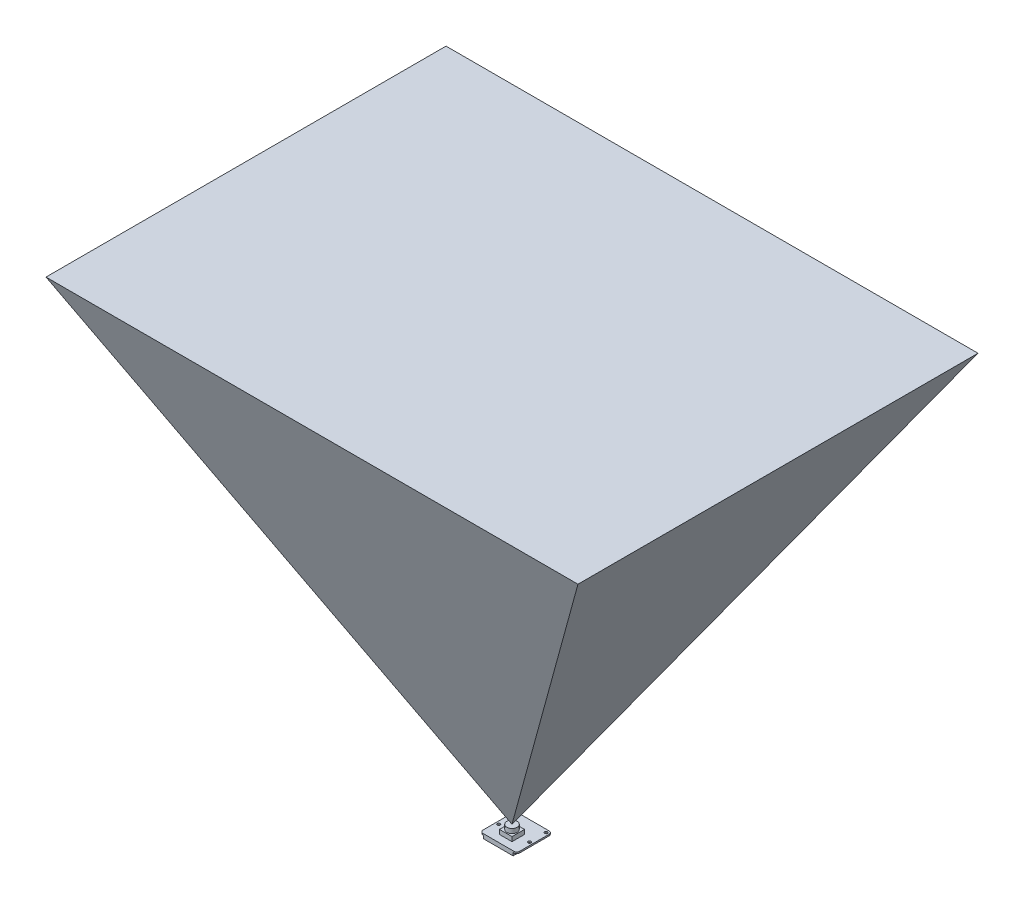
ISO-10303-21;
HEADER;
FILE_DESCRIPTION(('STEP AP214'),'2;1');
FILE_NAME('part.step','',(''),(''),'','','');
FILE_SCHEMA(('AUTOMOTIVE_DESIGN { 1 0 10303 214 1 1 1 1 }'));
ENDSEC;
DATA;
#1=APPLICATION_CONTEXT('core data for automotive mechanical design processes');
#2=APPLICATION_PROTOCOL_DEFINITION('international standard','automotive_design',2000,#1);
#3=PRODUCT_CONTEXT('',#1,'mechanical');
#4=PRODUCT('Part','Part','',(#3));
#5=PRODUCT_RELATED_PRODUCT_CATEGORY('part','',(#4));
#6=PRODUCT_DEFINITION_FORMATION('','',#4);
#7=PRODUCT_DEFINITION_CONTEXT('part definition',#1,'design');
#8=PRODUCT_DEFINITION('design','',#6,#7);
#9=PRODUCT_DEFINITION_SHAPE('','',#8);
#10=(LENGTH_UNIT() NAMED_UNIT(*) SI_UNIT(.MILLI.,.METRE.));
#11=(NAMED_UNIT(*) PLANE_ANGLE_UNIT() SI_UNIT($,.RADIAN.));
#12=(NAMED_UNIT(*) SI_UNIT($,.STERADIAN.) SOLID_ANGLE_UNIT());
#13=UNCERTAINTY_MEASURE_WITH_UNIT(LENGTH_MEASURE(1.E-05),#10,'distance_accuracy_value','');
#14=(GEOMETRIC_REPRESENTATION_CONTEXT(3) GLOBAL_UNCERTAINTY_ASSIGNED_CONTEXT((#13)) GLOBAL_UNIT_ASSIGNED_CONTEXT((#10,
#11,#12)) REPRESENTATION_CONTEXT('',''));
#15=CARTESIAN_POINT('',(0.,0.,0.));
#16=DIRECTION('',(0.,0.,1.));
#17=DIRECTION('',(1.,0.,0.));
#18=AXIS2_PLACEMENT_3D('',#15,#16,#17);
#19=CARTESIAN_POINT('',(193.471570023997,307.,200.));
#20=DIRECTION('',(-0.856267084600329,0.516533328866641,0.));
#21=DIRECTION('',(-0.516533328866641,-0.856267084600329,0.));
#22=AXIS2_PLACEMENT_3D('',#19,#20,#21);
#23=PLANE('',#22);
#24=DIRECTION('',(-0.481487702973172,-0.798171286643521,-0.36206655336201));
#25=VECTOR('',#24,1.);
#26=CARTESIAN_POINT('',(206.226287357831,328.143736552889,136.427259722615));
#27=LINE('',#26,#25);
#28=CARTESIAN_POINT('',(193.471570023997,307.,126.836035449074));
#29=VERTEX_POINT('',#28);
#30=CARTESIAN_POINT('',(12.5,7.,-9.24999999999999));
#31=VERTEX_POINT('',#30);
#32=EDGE_CURVE('E93',#29,#31,#27,.T.);
#33=ORIENTED_EDGE('',*,*,#32,.T.);
#34=DIRECTION('',(0.481487702973172,0.798171286643521,-0.36206655336201));
#35=VECTOR('',#34,1.);
#36=CARTESIAN_POINT('',(133.268934144774,207.200950009044,-100.065178599563));
#37=LINE('',#36,#35);
#38=CARTESIAN_POINT('',(193.471570023997,307.,-145.336035449074));
#39=VERTEX_POINT('',#38);
#40=EDGE_CURVE('E85',#31,#39,#37,.T.);
#41=ORIENTED_EDGE('',*,*,#40,.T.);
#42=DIRECTION('',(0.,0.,-1.));
#43=VECTOR('',#42,1.);
#44=CARTESIAN_POINT('',(193.471570023997,307.,200.));
#45=LINE('',#44,#43);
#46=EDGE_CURVE('E12',#29,#39,#45,.T.);
#47=ORIENTED_EDGE('',*,*,#46,.F.);
#48=EDGE_LOOP('',(#33,#41,#47));
#49=FACE_BOUND('',#48,.T.);
#50=ADVANCED_FACE('F55',(#49),#23,.F.);
#51=CARTESIAN_POINT('',(200.,307.,-145.336035449074));
#52=DIRECTION('',(0.,0.41310442982454,0.910683660806178));
#53=DIRECTION('',(0.,-0.910683660806178,0.41310442982454));
#54=AXIS2_PLACEMENT_3D('',#51,#52,#53);
#55=PLANE('',#54);
#56=ORIENTED_EDGE('',*,*,#40,.F.);
#57=DIRECTION('',(0.481487702973172,-0.798171286643521,0.36206655336201));
#58=VECTOR('',#57,1.);
#59=CARTESIAN_POINT('',(48.9786766065282,-53.4713932719229,18.1810405615259));
#60=LINE('',#59,#58);
#61=CARTESIAN_POINT('',(-168.471570023997,307.,-145.336035449074));
#62=VERTEX_POINT('',#61);
#63=EDGE_CURVE('E89',#62,#31,#60,.T.);
#64=ORIENTED_EDGE('',*,*,#63,.F.);
#65=DIRECTION('',(-1.,0.,0.));
#66=VECTOR('',#65,1.);
#67=CARTESIAN_POINT('',(200.,307.,-145.336035449074));
#68=LINE('',#67,#66);
#69=EDGE_CURVE('E64',#39,#62,#68,.T.);
#70=ORIENTED_EDGE('',*,*,#69,.F.);
#71=EDGE_LOOP('',(#56,#64,#70));
#72=FACE_BOUND('',#71,.T.);
#73=ADVANCED_FACE('F87',(#72),#55,.F.);
#74=CARTESIAN_POINT('',(12.5,7.,200.));
#75=DIRECTION('',(0.856267084600329,0.516533328866641,0.));
#76=DIRECTION('',(-0.516533328866641,0.856267084600329,0.));
#77=AXIS2_PLACEMENT_3D('',#74,#75,#76);
#78=PLANE('',#77);
#79=DIRECTION('',(0.,0.,-1.));
#80=VECTOR('',#79,1.);
#81=CARTESIAN_POINT('',(-168.471570023997,307.,200.));
#82=LINE('',#81,#80);
#83=CARTESIAN_POINT('',(-168.471570023997,307.,126.836035449074));
#84=VERTEX_POINT('',#83);
#85=EDGE_CURVE('E99',#84,#62,#82,.T.);
#86=ORIENTED_EDGE('',*,*,#85,.T.);
#87=ORIENTED_EDGE('',*,*,#63,.T.);
#88=DIRECTION('',(-0.481487702973172,0.798171286643521,0.36206655336201));
#89=VECTOR('',#88,1.);
#90=CARTESIAN_POINT('',(-23.9786766065282,67.4713932719229,18.1810405615259));
#91=LINE('',#90,#89);
#92=EDGE_CURVE('E59',#31,#84,#91,.T.);
#93=ORIENTED_EDGE('',*,*,#92,.T.);
#94=EDGE_LOOP('',(#86,#87,#93));
#95=FACE_BOUND('',#94,.T.);
#96=ADVANCED_FACE('F57',(#95),#78,.F.);
#97=CARTESIAN_POINT('',(200.,7.,-9.25));
#98=DIRECTION('',(0.,0.41310442982454,-0.910683660806178));
#99=DIRECTION('',(0.,0.910683660806178,0.41310442982454));
#100=AXIS2_PLACEMENT_3D('',#97,#98,#99);
#101=PLANE('',#100);
#102=ORIENTED_EDGE('',*,*,#32,.F.);
#103=DIRECTION('',(-1.,0.,0.));
#104=VECTOR('',#103,1.);
#105=CARTESIAN_POINT('',(200.,307.,126.836035449074));
#106=LINE('',#105,#104);
#107=EDGE_CURVE('E78',#29,#84,#106,.T.);
#108=ORIENTED_EDGE('',*,*,#107,.T.);
#109=ORIENTED_EDGE('',*,*,#92,.F.);
#110=EDGE_LOOP('',(#102,#108,#109));
#111=FACE_BOUND('',#110,.T.);
#112=ADVANCED_FACE('F101',(#111),#101,.F.);
#113=CARTESIAN_POINT('',(-168.471570023997,307.,200.));
#114=DIRECTION('',(0.,-1.,0.));
#115=DIRECTION('',(0.,0.,-1.));
#116=AXIS2_PLACEMENT_3D('',#113,#114,#115);
#117=PLANE('',#116);
#118=ORIENTED_EDGE('',*,*,#107,.F.);
#119=ORIENTED_EDGE('',*,*,#46,.T.);
#120=ORIENTED_EDGE('',*,*,#69,.T.);
#121=ORIENTED_EDGE('',*,*,#85,.F.);
#122=EDGE_LOOP('',(#118,#119,#120,#121));
#123=FACE_BOUND('',#122,.T.);
#124=ADVANCED_FACE('F105',(#123),#117,.F.);
#125=CLOSED_SHELL('',(#50,#73,#96,#112,#124));
#126=MANIFOLD_SOLID_BREP('B2',#125);
#127=CARTESIAN_POINT('',(0.,1.,0.));
#128=DIRECTION('',(0.,-1.,0.));
#129=DIRECTION('',(0.,0.,-1.));
#130=AXIS2_PLACEMENT_3D('',#127,#128,#129);
#131=PLANE('',#130);
#132=CARTESIAN_POINT('',(23.,1.,-10.7));
#133=DIRECTION('',(0.,1.,0.));
#134=DIRECTION('',(0.,0.,1.));
#135=AXIS2_PLACEMENT_3D('',#132,#133,#134);
#136=CIRCLE('',#135,1.);
#137=CARTESIAN_POINT('',(23.,1.,-9.7));
#138=VERTEX_POINT('',#137);
#139=EDGE_CURVE('E428',#138,#138,#136,.T.);
#140=ORIENTED_EDGE('',*,*,#139,.F.);
#141=EDGE_LOOP('',(#140));
#142=FACE_BOUND('',#141,.T.);
#143=CARTESIAN_POINT('',(23.,1.,-22.));
#144=DIRECTION('',(0.,1.,0.));
#145=DIRECTION('',(0.,0.,1.));
#146=AXIS2_PLACEMENT_3D('',#143,#144,#145);
#147=CIRCLE('',#146,1.);
#148=CARTESIAN_POINT('',(23.,1.,-21.));
#149=VERTEX_POINT('',#148);
#150=EDGE_CURVE('E431',#149,#149,#147,.T.);
#151=ORIENTED_EDGE('',*,*,#150,.F.);
#152=EDGE_LOOP('',(#151));
#153=FACE_BOUND('',#152,.T.);
#154=CARTESIAN_POINT('',(2.,1.,-22.));
#155=DIRECTION('',(0.,1.,0.));
#156=DIRECTION('',(0.,0.,1.));
#157=AXIS2_PLACEMENT_3D('',#154,#155,#156);
#158=CIRCLE('',#157,1.);
#159=CARTESIAN_POINT('',(2.,1.,-21.));
#160=VERTEX_POINT('',#159);
#161=EDGE_CURVE('E427',#160,#160,#158,.T.);
#162=ORIENTED_EDGE('',*,*,#161,.F.);
#163=EDGE_LOOP('',(#162));
#164=FACE_BOUND('',#163,.T.);
#165=CARTESIAN_POINT('',(2.,1.,-10.7));
#166=DIRECTION('',(0.,1.,0.));
#167=DIRECTION('',(0.,0.,1.));
#168=AXIS2_PLACEMENT_3D('',#165,#166,#167);
#169=CIRCLE('',#168,1.);
#170=CARTESIAN_POINT('',(2.,1.,-9.7));
#171=VERTEX_POINT('',#170);
#172=EDGE_CURVE('E357',#171,#171,#169,.T.);
#173=ORIENTED_EDGE('',*,*,#172,.F.);
#174=EDGE_LOOP('',(#173));
#175=FACE_BOUND('',#174,.T.);
#176=DIRECTION('',(1.,0.,0.));
#177=VECTOR('',#176,1.);
#178=CARTESIAN_POINT('',(0.,1.,0.));
#179=LINE('',#178,#177);
#180=CARTESIAN_POINT('',(2.,1.,0.));
#181=VERTEX_POINT('',#180);
#182=CARTESIAN_POINT('',(23.,1.,0.));
#183=VERTEX_POINT('',#182);
#184=EDGE_CURVE('E337',#181,#183,#179,.T.);
#185=ORIENTED_EDGE('',*,*,#184,.T.);
#186=CARTESIAN_POINT('',(23.,1.,-2.));
#187=DIRECTION('',(0.,-1.,0.));
#188=DIRECTION('',(0.,0.,-1.));
#189=AXIS2_PLACEMENT_3D('',#186,#187,#188);
#190=CIRCLE('',#189,2.);
#191=CARTESIAN_POINT('',(25.,1.,-2.));
#192=VERTEX_POINT('',#191);
#193=EDGE_CURVE('E388',#183,#192,#190,.F.);
#194=ORIENTED_EDGE('',*,*,#193,.T.);
#195=DIRECTION('',(0.,0.,-1.));
#196=VECTOR('',#195,1.);
#197=CARTESIAN_POINT('',(25.,1.,0.));
#198=LINE('',#197,#196);
#199=CARTESIAN_POINT('',(25.,1.,-22.));
#200=VERTEX_POINT('',#199);
#201=EDGE_CURVE('E341',#192,#200,#198,.T.);
#202=ORIENTED_EDGE('',*,*,#201,.T.);
#203=CARTESIAN_POINT('',(23.,1.,-22.));
#204=DIRECTION('',(0.,-1.,0.));
#205=DIRECTION('',(0.,0.,-1.));
#206=AXIS2_PLACEMENT_3D('',#203,#204,#205);
#207=CIRCLE('',#206,2.);
#208=CARTESIAN_POINT('',(23.,1.,-24.));
#209=VERTEX_POINT('',#208);
#210=EDGE_CURVE('E168',#200,#209,#207,.F.);
#211=ORIENTED_EDGE('',*,*,#210,.T.);
#212=DIRECTION('',(-1.,0.,0.));
#213=VECTOR('',#212,1.);
#214=CARTESIAN_POINT('',(0.,1.,-24.));
#215=LINE('',#214,#213);
#216=CARTESIAN_POINT('',(2.,1.,-24.));
#217=VERTEX_POINT('',#216);
#218=EDGE_CURVE('E299',#209,#217,#215,.T.);
#219=ORIENTED_EDGE('',*,*,#218,.T.);
#220=CARTESIAN_POINT('',(2.,1.,-22.));
#221=DIRECTION('',(0.,-1.,0.));
#222=DIRECTION('',(0.,0.,-1.));
#223=AXIS2_PLACEMENT_3D('',#220,#221,#222);
#224=CIRCLE('',#223,2.);
#225=CARTESIAN_POINT('',(0.,1.,-22.));
#226=VERTEX_POINT('',#225);
#227=EDGE_CURVE('E383',#217,#226,#224,.F.);
#228=ORIENTED_EDGE('',*,*,#227,.T.);
#229=DIRECTION('',(0.,0.,1.));
#230=VECTOR('',#229,1.);
#231=CARTESIAN_POINT('',(0.,1.,0.));
#232=LINE('',#231,#230);
#233=CARTESIAN_POINT('',(0.,1.,-2.));
#234=VERTEX_POINT('',#233);
#235=EDGE_CURVE('E334',#226,#234,#232,.T.);
#236=ORIENTED_EDGE('',*,*,#235,.T.);
#237=CARTESIAN_POINT('',(2.,1.,-2.));
#238=DIRECTION('',(0.,-1.,0.));
#239=DIRECTION('',(0.,0.,-1.));
#240=AXIS2_PLACEMENT_3D('',#237,#238,#239);
#241=CIRCLE('',#240,2.);
#242=EDGE_CURVE('E386',#234,#181,#241,.F.);
#243=ORIENTED_EDGE('',*,*,#242,.T.);
#244=EDGE_LOOP('',(#185,#194,#202,#211,#219,#228,#236,#243));
#245=FACE_BOUND('',#244,.T.);
#246=DIRECTION('',(0.,0.,1.));
#247=VECTOR('',#246,1.);
#248=CARTESIAN_POINT('',(8.25,1.,-13.5));
#249=LINE('',#248,#247);
#250=CARTESIAN_POINT('',(8.25,1.,-13.5));
#251=VERTEX_POINT('',#250);
#252=CARTESIAN_POINT('',(8.25,1.,-5.));
#253=VERTEX_POINT('',#252);
#254=EDGE_CURVE('E290',#251,#253,#249,.T.);
#255=ORIENTED_EDGE('',*,*,#254,.F.);
#256=DIRECTION('',(-1.,0.,0.));
#257=VECTOR('',#256,1.);
#258=CARTESIAN_POINT('',(8.25,1.,-13.5));
#259=LINE('',#258,#257);
#260=CARTESIAN_POINT('',(16.75,1.,-13.5));
#261=VERTEX_POINT('',#260);
#262=EDGE_CURVE('E305',#261,#251,#259,.T.);
#263=ORIENTED_EDGE('',*,*,#262,.F.);
#264=DIRECTION('',(0.,0.,-1.));
#265=VECTOR('',#264,1.);
#266=CARTESIAN_POINT('',(16.75,1.,-13.5));
#267=LINE('',#266,#265);
#268=CARTESIAN_POINT('',(16.75,1.,-5.));
#269=VERTEX_POINT('',#268);
#270=EDGE_CURVE('E317',#269,#261,#267,.T.);
#271=ORIENTED_EDGE('',*,*,#270,.F.);
#272=DIRECTION('',(1.,0.,0.));
#273=VECTOR('',#272,1.);
#274=CARTESIAN_POINT('',(8.25,1.,-5.));
#275=LINE('',#274,#273);
#276=EDGE_CURVE('E314',#253,#269,#275,.T.);
#277=ORIENTED_EDGE('',*,*,#276,.F.);
#278=EDGE_LOOP('',(#255,#263,#271,#277));
#279=FACE_BOUND('',#278,.T.);
#280=ADVANCED_FACE('F147',(#142,#153,#164,#175,#245,#279),#131,.F.);
#281=CARTESIAN_POINT('',(0.,1.,0.));
#282=DIRECTION('',(1.,0.,0.));
#283=DIRECTION('',(0.,0.,-1.));
#284=AXIS2_PLACEMENT_3D('',#281,#282,#283);
#285=PLANE('',#284);
#286=DIRECTION('',(0.,0.,1.));
#287=VECTOR('',#286,1.);
#288=CARTESIAN_POINT('',(0.,0.,0.));
#289=LINE('',#288,#287);
#290=CARTESIAN_POINT('',(0.,0.,-22.));
#291=VERTEX_POINT('',#290);
#292=CARTESIAN_POINT('',(0.,0.,-2.));
#293=VERTEX_POINT('',#292);
#294=EDGE_CURVE('E333',#291,#293,#289,.T.);
#295=ORIENTED_EDGE('',*,*,#294,.T.);
#296=DIRECTION('',(0.,-1.,0.));
#297=VECTOR('',#296,1.);
#298=CARTESIAN_POINT('',(0.,1.,-2.));
#299=LINE('',#298,#297);
#300=EDGE_CURVE('E393',#293,#234,#299,.F.);
#301=ORIENTED_EDGE('',*,*,#300,.T.);
#302=ORIENTED_EDGE('',*,*,#235,.F.);
#303=DIRECTION('',(0.,-1.,0.));
#304=VECTOR('',#303,1.);
#305=CARTESIAN_POINT('',(0.,1.,-22.));
#306=LINE('',#305,#304);
#307=EDGE_CURVE('E390',#226,#291,#306,.T.);
#308=ORIENTED_EDGE('',*,*,#307,.T.);
#309=EDGE_LOOP('',(#295,#301,#302,#308));
#310=FACE_BOUND('',#309,.T.);
#311=ADVANCED_FACE('F397',(#310),#285,.F.);
#312=CARTESIAN_POINT('',(0.,1.,0.));
#313=DIRECTION('',(0.,0.,-1.));
#314=DIRECTION('',(-1.,0.,0.));
#315=AXIS2_PLACEMENT_3D('',#312,#313,#314);
#316=PLANE('',#315);
#317=DIRECTION('',(1.,0.,0.));
#318=VECTOR('',#317,1.);
#319=CARTESIAN_POINT('',(0.,0.,0.));
#320=LINE('',#319,#318);
#321=CARTESIAN_POINT('',(22.5,0.,0.));
#322=VERTEX_POINT('',#321);
#323=CARTESIAN_POINT('',(23.,0.,0.));
#324=VERTEX_POINT('',#323);
#325=EDGE_CURVE('E346',#322,#324,#320,.T.);
#326=ORIENTED_EDGE('',*,*,#325,.T.);
#327=DIRECTION('',(0.,-1.,0.));
#328=VECTOR('',#327,1.);
#329=CARTESIAN_POINT('',(23.,1.,0.));
#330=LINE('',#329,#328);
#331=EDGE_CURVE('E381',#324,#183,#330,.F.);
#332=ORIENTED_EDGE('',*,*,#331,.T.);
#333=ORIENTED_EDGE('',*,*,#184,.F.);
#334=DIRECTION('',(0.,-1.,0.));
#335=VECTOR('',#334,1.);
#336=CARTESIAN_POINT('',(2.,1.,0.));
#337=LINE('',#336,#335);
#338=CARTESIAN_POINT('',(2.,0.,0.));
#339=VERTEX_POINT('',#338);
#340=EDGE_CURVE('E378',#181,#339,#337,.T.);
#341=ORIENTED_EDGE('',*,*,#340,.T.);
#342=CARTESIAN_POINT('',(2.5,0.,0.));
#343=VERTEX_POINT('',#342);
#344=EDGE_CURVE('E347',#339,#343,#320,.T.);
#345=ORIENTED_EDGE('',*,*,#344,.T.);
#346=DIRECTION('',(0.,1.,0.));
#347=VECTOR('',#346,1.);
#348=CARTESIAN_POINT('',(2.5,-2.,0.));
#349=LINE('',#348,#347);
#350=CARTESIAN_POINT('',(2.5,-2.,0.));
#351=VERTEX_POINT('',#350);
#352=EDGE_CURVE('E416',#351,#343,#349,.T.);
#353=ORIENTED_EDGE('',*,*,#352,.F.);
#354=DIRECTION('',(-1.,0.,0.));
#355=VECTOR('',#354,1.);
#356=CARTESIAN_POINT('',(2.5,-2.,0.));
#357=LINE('',#356,#355);
#358=CARTESIAN_POINT('',(22.5,-2.,0.));
#359=VERTEX_POINT('',#358);
#360=EDGE_CURVE('E278',#359,#351,#357,.T.);
#361=ORIENTED_EDGE('',*,*,#360,.F.);
#362=DIRECTION('',(0.,1.,0.));
#363=VECTOR('',#362,1.);
#364=CARTESIAN_POINT('',(22.5,-2.,0.));
#365=LINE('',#364,#363);
#366=EDGE_CURVE('E292',#359,#322,#365,.T.);
#367=ORIENTED_EDGE('',*,*,#366,.T.);
#368=EDGE_LOOP('',(#326,#332,#333,#341,#345,#353,#361,#367));
#369=FACE_BOUND('',#368,.T.);
#370=ADVANCED_FACE('F410',(#369),#316,.F.);
#371=CARTESIAN_POINT('',(25.,1.,0.));
#372=DIRECTION('',(-1.,0.,0.));
#373=DIRECTION('',(0.,0.,1.));
#374=AXIS2_PLACEMENT_3D('',#371,#372,#373);
#375=PLANE('',#374);
#376=ORIENTED_EDGE('',*,*,#201,.F.);
#377=DIRECTION('',(0.,-1.,0.));
#378=VECTOR('',#377,1.);
#379=CARTESIAN_POINT('',(25.,1.,-2.));
#380=LINE('',#379,#378);
#381=CARTESIAN_POINT('',(25.,0.,-2.));
#382=VERTEX_POINT('',#381);
#383=EDGE_CURVE('E367',#192,#382,#380,.T.);
#384=ORIENTED_EDGE('',*,*,#383,.T.);
#385=DIRECTION('',(0.,0.,-1.));
#386=VECTOR('',#385,1.);
#387=CARTESIAN_POINT('',(25.,0.,0.));
#388=LINE('',#387,#386);
#389=CARTESIAN_POINT('',(25.,0.,-22.));
#390=VERTEX_POINT('',#389);
#391=EDGE_CURVE('E349',#382,#390,#388,.T.);
#392=ORIENTED_EDGE('',*,*,#391,.T.);
#393=DIRECTION('',(0.,-1.,0.));
#394=VECTOR('',#393,1.);
#395=CARTESIAN_POINT('',(25.,1.,-22.));
#396=LINE('',#395,#394);
#397=EDGE_CURVE('E298',#390,#200,#396,.F.);
#398=ORIENTED_EDGE('',*,*,#397,.T.);
#399=EDGE_LOOP('',(#376,#384,#392,#398));
#400=FACE_BOUND('',#399,.T.);
#401=ADVANCED_FACE('F503',(#400),#375,.F.);
#402=CARTESIAN_POINT('',(0.,1.,-24.));
#403=DIRECTION('',(0.,0.,1.));
#404=DIRECTION('',(1.,0.,0.));
#405=AXIS2_PLACEMENT_3D('',#402,#403,#404);
#406=PLANE('',#405);
#407=ORIENTED_EDGE('',*,*,#218,.F.);
#408=DIRECTION('',(0.,-1.,0.));
#409=VECTOR('',#408,1.);
#410=CARTESIAN_POINT('',(23.,1.,-24.));
#411=LINE('',#410,#409);
#412=CARTESIAN_POINT('',(23.,0.,-24.));
#413=VERTEX_POINT('',#412);
#414=EDGE_CURVE('E53',#209,#413,#411,.T.);
#415=ORIENTED_EDGE('',*,*,#414,.T.);
#416=DIRECTION('',(-1.,0.,0.));
#417=VECTOR('',#416,1.);
#418=CARTESIAN_POINT('',(0.,0.,-24.));
#419=LINE('',#418,#417);
#420=CARTESIAN_POINT('',(2.,0.,-24.));
#421=VERTEX_POINT('',#420);
#422=EDGE_CURVE('E338',#413,#421,#419,.T.);
#423=ORIENTED_EDGE('',*,*,#422,.T.);
#424=DIRECTION('',(0.,-1.,0.));
#425=VECTOR('',#424,1.);
#426=CARTESIAN_POINT('',(2.,1.,-24.));
#427=LINE('',#426,#425);
#428=EDGE_CURVE('E155',#421,#217,#427,.F.);
#429=ORIENTED_EDGE('',*,*,#428,.T.);
#430=EDGE_LOOP('',(#407,#415,#423,#429));
#431=FACE_BOUND('',#430,.T.);
#432=ADVANCED_FACE('F499',(#431),#406,.F.);
#433=CARTESIAN_POINT('',(0.,0.,0.));
#434=DIRECTION('',(0.,-1.,0.));
#435=DIRECTION('',(0.,0.,-1.));
#436=AXIS2_PLACEMENT_3D('',#433,#434,#435);
#437=PLANE('',#436);
#438=CARTESIAN_POINT('',(23.,0.,-10.7));
#439=DIRECTION('',(0.,-1.,0.));
#440=DIRECTION('',(0.,0.,-1.));
#441=AXIS2_PLACEMENT_3D('',#438,#439,#440);
#442=CIRCLE('',#441,1.);
#443=CARTESIAN_POINT('',(23.,0.,-11.7));
#444=VERTEX_POINT('',#443);
#445=EDGE_CURVE('E363',#444,#444,#442,.T.);
#446=ORIENTED_EDGE('',*,*,#445,.F.);
#447=EDGE_LOOP('',(#446));
#448=FACE_BOUND('',#447,.T.);
#449=CARTESIAN_POINT('',(23.,0.,-22.));
#450=DIRECTION('',(0.,-1.,0.));
#451=DIRECTION('',(0.,0.,-1.));
#452=AXIS2_PLACEMENT_3D('',#449,#450,#451);
#453=CIRCLE('',#452,1.);
#454=CARTESIAN_POINT('',(23.,0.,-23.));
#455=VERTEX_POINT('',#454);
#456=EDGE_CURVE('E360',#455,#455,#453,.T.);
#457=ORIENTED_EDGE('',*,*,#456,.F.);
#458=EDGE_LOOP('',(#457));
#459=FACE_BOUND('',#458,.T.);
#460=CARTESIAN_POINT('',(2.,0.,-22.));
#461=DIRECTION('',(0.,-1.,0.));
#462=DIRECTION('',(0.,0.,-1.));
#463=AXIS2_PLACEMENT_3D('',#460,#461,#462);
#464=CIRCLE('',#463,1.);
#465=CARTESIAN_POINT('',(2.,0.,-23.));
#466=VERTEX_POINT('',#465);
#467=EDGE_CURVE('E356',#466,#466,#464,.T.);
#468=ORIENTED_EDGE('',*,*,#467,.F.);
#469=EDGE_LOOP('',(#468));
#470=FACE_BOUND('',#469,.T.);
#471=CARTESIAN_POINT('',(2.,0.,-10.7));
#472=DIRECTION('',(0.,-1.,0.));
#473=DIRECTION('',(0.,0.,-1.));
#474=AXIS2_PLACEMENT_3D('',#471,#472,#473);
#475=CIRCLE('',#474,1.);
#476=CARTESIAN_POINT('',(2.,0.,-11.7));
#477=VERTEX_POINT('',#476);
#478=EDGE_CURVE('E353',#477,#477,#475,.T.);
#479=ORIENTED_EDGE('',*,*,#478,.F.);
#480=EDGE_LOOP('',(#479));
#481=FACE_BOUND('',#480,.T.);
#482=ORIENTED_EDGE('',*,*,#391,.F.);
#483=CARTESIAN_POINT('',(23.,0.,-2.));
#484=DIRECTION('',(0.,-1.,0.));
#485=DIRECTION('',(0.,0.,-1.));
#486=AXIS2_PLACEMENT_3D('',#483,#484,#485);
#487=CIRCLE('',#486,2.);
#488=EDGE_CURVE('E376',#382,#324,#487,.T.);
#489=ORIENTED_EDGE('',*,*,#488,.T.);
#490=ORIENTED_EDGE('',*,*,#325,.F.);
#491=DIRECTION('',(0.,0.,1.));
#492=VECTOR('',#491,1.);
#493=CARTESIAN_POINT('',(22.5,0.,0.));
#494=LINE('',#493,#492);
#495=CARTESIAN_POINT('',(22.5,0.,-5.4));
#496=VERTEX_POINT('',#495);
#497=EDGE_CURVE('E282',#496,#322,#494,.T.);
#498=ORIENTED_EDGE('',*,*,#497,.F.);
#499=DIRECTION('',(1.,0.,0.));
#500=VECTOR('',#499,1.);
#501=CARTESIAN_POINT('',(2.5,0.,-5.4));
#502=LINE('',#501,#500);
#503=CARTESIAN_POINT('',(2.5,0.,-5.4));
#504=VERTEX_POINT('',#503);
#505=EDGE_CURVE('E414',#504,#496,#502,.T.);
#506=ORIENTED_EDGE('',*,*,#505,.F.);
#507=DIRECTION('',(0.,0.,-1.));
#508=VECTOR('',#507,1.);
#509=CARTESIAN_POINT('',(2.5,0.,0.));
#510=LINE('',#509,#508);
#511=EDGE_CURVE('E286',#343,#504,#510,.T.);
#512=ORIENTED_EDGE('',*,*,#511,.F.);
#513=ORIENTED_EDGE('',*,*,#344,.F.);
#514=CARTESIAN_POINT('',(2.,0.,-2.));
#515=DIRECTION('',(0.,-1.,0.));
#516=DIRECTION('',(0.,0.,-1.));
#517=AXIS2_PLACEMENT_3D('',#514,#515,#516);
#518=CIRCLE('',#517,2.);
#519=EDGE_CURVE('E374',#339,#293,#518,.T.);
#520=ORIENTED_EDGE('',*,*,#519,.T.);
#521=ORIENTED_EDGE('',*,*,#294,.F.);
#522=CARTESIAN_POINT('',(2.,0.,-22.));
#523=DIRECTION('',(0.,-1.,0.));
#524=DIRECTION('',(0.,0.,-1.));
#525=AXIS2_PLACEMENT_3D('',#522,#523,#524);
#526=CIRCLE('',#525,2.);
#527=EDGE_CURVE('E370',#291,#421,#526,.T.);
#528=ORIENTED_EDGE('',*,*,#527,.T.);
#529=ORIENTED_EDGE('',*,*,#422,.F.);
#530=CARTESIAN_POINT('',(23.,0.,-22.));
#531=DIRECTION('',(0.,-1.,0.));
#532=DIRECTION('',(0.,0.,-1.));
#533=AXIS2_PLACEMENT_3D('',#530,#531,#532);
#534=CIRCLE('',#533,2.);
#535=EDGE_CURVE('E372',#413,#390,#534,.T.);
#536=ORIENTED_EDGE('',*,*,#535,.T.);
#537=EDGE_LOOP('',(#482,#489,#490,#498,#506,#512,#513,#520,#521,#528,#529,#536));
#538=FACE_BOUND('',#537,.T.);
#539=ADVANCED_FACE('F413',(#448,#459,#470,#481,#538),#437,.T.);
#540=CARTESIAN_POINT('',(8.25,4.,-13.5));
#541=DIRECTION('',(1.,0.,0.));
#542=DIRECTION('',(0.,0.,-1.));
#543=AXIS2_PLACEMENT_3D('',#540,#541,#542);
#544=PLANE('',#543);
#545=ORIENTED_EDGE('',*,*,#254,.T.);
#546=DIRECTION('',(0.,-1.,0.));
#547=VECTOR('',#546,1.);
#548=CARTESIAN_POINT('',(8.25,4.,-5.));
#549=LINE('',#548,#547);
#550=CARTESIAN_POINT('',(8.25,4.,-5.));
#551=VERTEX_POINT('',#550);
#552=EDGE_CURVE('E330',#551,#253,#549,.T.);
#553=ORIENTED_EDGE('',*,*,#552,.F.);
#554=DIRECTION('',(0.,0.,1.));
#555=VECTOR('',#554,1.);
#556=CARTESIAN_POINT('',(8.25,4.,-13.5));
#557=LINE('',#556,#555);
#558=CARTESIAN_POINT('',(8.25,4.,-13.5));
#559=VERTEX_POINT('',#558);
#560=EDGE_CURVE('E301',#559,#551,#557,.T.);
#561=ORIENTED_EDGE('',*,*,#560,.F.);
#562=DIRECTION('',(0.,-1.,0.));
#563=VECTOR('',#562,1.);
#564=CARTESIAN_POINT('',(8.25,4.,-13.5));
#565=LINE('',#564,#563);
#566=EDGE_CURVE('E311',#559,#251,#565,.T.);
#567=ORIENTED_EDGE('',*,*,#566,.T.);
#568=EDGE_LOOP('',(#545,#553,#561,#567));
#569=FACE_BOUND('',#568,.T.);
#570=ADVANCED_FACE('F492',(#569),#544,.F.);
#571=CARTESIAN_POINT('',(8.25,4.,-5.));
#572=DIRECTION('',(0.,0.,-1.));
#573=DIRECTION('',(-1.,0.,0.));
#574=AXIS2_PLACEMENT_3D('',#571,#572,#573);
#575=PLANE('',#574);
#576=ORIENTED_EDGE('',*,*,#276,.T.);
#577=DIRECTION('',(0.,-1.,0.));
#578=VECTOR('',#577,1.);
#579=CARTESIAN_POINT('',(16.75,4.,-5.));
#580=LINE('',#579,#578);
#581=CARTESIAN_POINT('',(16.75,4.,-5.));
#582=VERTEX_POINT('',#581);
#583=EDGE_CURVE('E327',#582,#269,#580,.T.);
#584=ORIENTED_EDGE('',*,*,#583,.F.);
#585=DIRECTION('',(1.,0.,0.));
#586=VECTOR('',#585,1.);
#587=CARTESIAN_POINT('',(8.25,4.,-5.));
#588=LINE('',#587,#586);
#589=EDGE_CURVE('E304',#551,#582,#588,.T.);
#590=ORIENTED_EDGE('',*,*,#589,.F.);
#591=ORIENTED_EDGE('',*,*,#552,.T.);
#592=EDGE_LOOP('',(#576,#584,#590,#591));
#593=FACE_BOUND('',#592,.T.);
#594=ADVANCED_FACE('F488',(#593),#575,.F.);
#595=CARTESIAN_POINT('',(16.75,4.,-13.5));
#596=DIRECTION('',(-1.,0.,0.));
#597=DIRECTION('',(0.,0.,1.));
#598=AXIS2_PLACEMENT_3D('',#595,#596,#597);
#599=PLANE('',#598);
#600=ORIENTED_EDGE('',*,*,#270,.T.);
#601=DIRECTION('',(0.,-1.,0.));
#602=VECTOR('',#601,1.);
#603=CARTESIAN_POINT('',(16.75,4.,-13.5));
#604=LINE('',#603,#602);
#605=CARTESIAN_POINT('',(16.75,4.,-13.5));
#606=VERTEX_POINT('',#605);
#607=EDGE_CURVE('E324',#606,#261,#604,.T.);
#608=ORIENTED_EDGE('',*,*,#607,.F.);
#609=DIRECTION('',(0.,0.,-1.));
#610=VECTOR('',#609,1.);
#611=CARTESIAN_POINT('',(16.75,4.,-13.5));
#612=LINE('',#611,#610);
#613=EDGE_CURVE('E307',#582,#606,#612,.T.);
#614=ORIENTED_EDGE('',*,*,#613,.F.);
#615=ORIENTED_EDGE('',*,*,#583,.T.);
#616=EDGE_LOOP('',(#600,#608,#614,#615));
#617=FACE_BOUND('',#616,.T.);
#618=ADVANCED_FACE('F484',(#617),#599,.F.);
#619=CARTESIAN_POINT('',(8.25,4.,-13.5));
#620=DIRECTION('',(0.,0.,1.));
#621=DIRECTION('',(1.,0.,0.));
#622=AXIS2_PLACEMENT_3D('',#619,#620,#621);
#623=PLANE('',#622);
#624=ORIENTED_EDGE('',*,*,#262,.T.);
#625=ORIENTED_EDGE('',*,*,#566,.F.);
#626=DIRECTION('',(-1.,0.,0.));
#627=VECTOR('',#626,1.);
#628=CARTESIAN_POINT('',(8.25,4.,-13.5));
#629=LINE('',#628,#627);
#630=EDGE_CURVE('E309',#606,#559,#629,.T.);
#631=ORIENTED_EDGE('',*,*,#630,.F.);
#632=ORIENTED_EDGE('',*,*,#607,.T.);
#633=EDGE_LOOP('',(#624,#625,#631,#632));
#634=FACE_BOUND('',#633,.T.);
#635=ADVANCED_FACE('F480',(#634),#623,.F.);
#636=CARTESIAN_POINT('',(0.,4.,0.));
#637=DIRECTION('',(0.,1.,0.));
#638=DIRECTION('',(0.,0.,1.));
#639=AXIS2_PLACEMENT_3D('',#636,#637,#638);
#640=PLANE('',#639);
#641=CARTESIAN_POINT('',(12.5,4.,-9.25));
#642=DIRECTION('',(0.,1.,0.));
#643=DIRECTION('',(0.,0.,1.));
#644=AXIS2_PLACEMENT_3D('',#641,#642,#643);
#645=CIRCLE('',#644,3.5);
#646=CARTESIAN_POINT('',(12.5,4.,-5.75));
#647=VERTEX_POINT('',#646);
#648=EDGE_CURVE('E296',#647,#647,#645,.T.);
#649=ORIENTED_EDGE('',*,*,#648,.F.);
#650=EDGE_LOOP('',(#649));
#651=FACE_BOUND('',#650,.T.);
#652=ORIENTED_EDGE('',*,*,#560,.T.);
#653=ORIENTED_EDGE('',*,*,#589,.T.);
#654=ORIENTED_EDGE('',*,*,#613,.T.);
#655=ORIENTED_EDGE('',*,*,#630,.T.);
#656=EDGE_LOOP('',(#652,#653,#654,#655));
#657=FACE_BOUND('',#656,.T.);
#658=ADVANCED_FACE('F476',(#651,#657),#640,.T.);
#659=CARTESIAN_POINT('',(12.5,22.8994949366117,-9.25));
#660=DIRECTION('',(0.,-1.,0.));
#661=DIRECTION('',(0.,0.,-1.));
#662=AXIS2_PLACEMENT_3D('',#659,#660,#661);
#663=CYLINDRICAL_SURFACE('',#662,3.5);
#664=CARTESIAN_POINT('',(12.5,7.,-9.25));
#665=DIRECTION('',(0.,-1.,0.));
#666=DIRECTION('',(0.,0.,-1.));
#667=AXIS2_PLACEMENT_3D('',#664,#665,#666);
#668=CIRCLE('',#667,3.5);
#669=CARTESIAN_POINT('',(12.5,7.,-12.75));
#670=VERTEX_POINT('',#669);
#671=EDGE_CURVE('E287',#670,#670,#668,.T.);
#672=ORIENTED_EDGE('',*,*,#671,.T.);
#673=EDGE_LOOP('',(#672));
#674=FACE_BOUND('',#673,.T.);
#675=ORIENTED_EDGE('',*,*,#648,.T.);
#676=EDGE_LOOP('',(#675));
#677=FACE_BOUND('',#676,.T.);
#678=ADVANCED_FACE('F472',(#674,#677),#663,.T.);
#679=CARTESIAN_POINT('',(0.,7.,0.));
#680=DIRECTION('',(0.,-1.,0.));
#681=DIRECTION('',(0.,0.,-1.));
#682=AXIS2_PLACEMENT_3D('',#679,#680,#681);
#683=PLANE('',#682);
#684=ORIENTED_EDGE('',*,*,#671,.F.);
#685=EDGE_LOOP('',(#684));
#686=FACE_BOUND('',#685,.T.);
#687=ADVANCED_FACE('F469',(#686),#683,.F.);
#688=CARTESIAN_POINT('',(2.5,-2.,0.));
#689=DIRECTION('',(1.,0.,0.));
#690=DIRECTION('',(0.,0.,-1.));
#691=AXIS2_PLACEMENT_3D('',#688,#689,#690);
#692=PLANE('',#691);
#693=ORIENTED_EDGE('',*,*,#511,.T.);
#694=DIRECTION('',(0.,1.,0.));
#695=VECTOR('',#694,1.);
#696=CARTESIAN_POINT('',(2.5,-2.,-5.4));
#697=LINE('',#696,#695);
#698=CARTESIAN_POINT('',(2.5,-2.,-5.4));
#699=VERTEX_POINT('',#698);
#700=EDGE_CURVE('E266',#699,#504,#697,.T.);
#701=ORIENTED_EDGE('',*,*,#700,.F.);
#702=DIRECTION('',(0.,0.,-1.));
#703=VECTOR('',#702,1.);
#704=CARTESIAN_POINT('',(2.5,-2.,0.));
#705=LINE('',#704,#703);
#706=EDGE_CURVE('E273',#351,#699,#705,.T.);
#707=ORIENTED_EDGE('',*,*,#706,.F.);
#708=ORIENTED_EDGE('',*,*,#352,.T.);
#709=EDGE_LOOP('',(#693,#701,#707,#708));
#710=FACE_BOUND('',#709,.T.);
#711=ADVANCED_FACE('F284',(#710),#692,.F.);
#712=CARTESIAN_POINT('',(2.5,-2.,-5.4));
#713=DIRECTION('',(0.,0.,1.));
#714=DIRECTION('',(1.,0.,0.));
#715=AXIS2_PLACEMENT_3D('',#712,#713,#714);
#716=PLANE('',#715);
#717=ORIENTED_EDGE('',*,*,#505,.T.);
#718=DIRECTION('',(0.,1.,0.));
#719=VECTOR('',#718,1.);
#720=CARTESIAN_POINT('',(22.5,-2.,-5.4));
#721=LINE('',#720,#719);
#722=CARTESIAN_POINT('',(22.5,-2.,-5.4));
#723=VERTEX_POINT('',#722);
#724=EDGE_CURVE('E269',#723,#496,#721,.T.);
#725=ORIENTED_EDGE('',*,*,#724,.F.);
#726=DIRECTION('',(1.,0.,0.));
#727=VECTOR('',#726,1.);
#728=CARTESIAN_POINT('',(2.5,-2.,-5.4));
#729=LINE('',#728,#727);
#730=EDGE_CURVE('E261',#699,#723,#729,.T.);
#731=ORIENTED_EDGE('',*,*,#730,.F.);
#732=ORIENTED_EDGE('',*,*,#700,.T.);
#733=EDGE_LOOP('',(#717,#725,#731,#732));
#734=FACE_BOUND('',#733,.T.);
#735=ADVANCED_FACE('F264',(#734),#716,.F.);
#736=CARTESIAN_POINT('',(22.5,-2.,0.));
#737=DIRECTION('',(-1.,0.,0.));
#738=DIRECTION('',(0.,0.,1.));
#739=AXIS2_PLACEMENT_3D('',#736,#737,#738);
#740=PLANE('',#739);
#741=ORIENTED_EDGE('',*,*,#497,.T.);
#742=ORIENTED_EDGE('',*,*,#366,.F.);
#743=DIRECTION('',(0.,0.,1.));
#744=VECTOR('',#743,1.);
#745=CARTESIAN_POINT('',(22.5,-2.,0.));
#746=LINE('',#745,#744);
#747=EDGE_CURVE('E272',#723,#359,#746,.T.);
#748=ORIENTED_EDGE('',*,*,#747,.F.);
#749=ORIENTED_EDGE('',*,*,#724,.T.);
#750=EDGE_LOOP('',(#741,#742,#748,#749));
#751=FACE_BOUND('',#750,.T.);
#752=ADVANCED_FACE('F456',(#751),#740,.F.);
#753=CARTESIAN_POINT('',(0.,-2.,0.));
#754=DIRECTION('',(0.,-1.,0.));
#755=DIRECTION('',(0.,0.,-1.));
#756=AXIS2_PLACEMENT_3D('',#753,#754,#755);
#757=PLANE('',#756);
#758=ORIENTED_EDGE('',*,*,#706,.T.);
#759=ORIENTED_EDGE('',*,*,#730,.T.);
#760=ORIENTED_EDGE('',*,*,#747,.T.);
#761=ORIENTED_EDGE('',*,*,#360,.T.);
#762=EDGE_LOOP('',(#758,#759,#760,#761));
#763=FACE_BOUND('',#762,.T.);
#764=ADVANCED_FACE('F276',(#763),#757,.T.);
#765=CARTESIAN_POINT('',(2.,-2.,-10.7));
#766=DIRECTION('',(0.,1.,0.));
#767=DIRECTION('',(0.,0.,1.));
#768=AXIS2_PLACEMENT_3D('',#765,#766,#767);
#769=CYLINDRICAL_SURFACE('',#768,1.);
#770=ORIENTED_EDGE('',*,*,#478,.T.);
#771=EDGE_LOOP('',(#770));
#772=FACE_BOUND('',#771,.T.);
#773=ORIENTED_EDGE('',*,*,#172,.T.);
#774=EDGE_LOOP('',(#773));
#775=FACE_BOUND('',#774,.T.);
#776=ADVANCED_FACE('F445',(#772,#775),#769,.F.);
#777=CARTESIAN_POINT('',(2.,-2.,-22.));
#778=DIRECTION('',(0.,1.,0.));
#779=DIRECTION('',(0.,0.,1.));
#780=AXIS2_PLACEMENT_3D('',#777,#778,#779);
#781=CYLINDRICAL_SURFACE('',#780,1.);
#782=ORIENTED_EDGE('',*,*,#467,.T.);
#783=EDGE_LOOP('',(#782));
#784=FACE_BOUND('',#783,.T.);
#785=ORIENTED_EDGE('',*,*,#161,.T.);
#786=EDGE_LOOP('',(#785));
#787=FACE_BOUND('',#786,.T.);
#788=ADVANCED_FACE('F437',(#784,#787),#781,.F.);
#789=CARTESIAN_POINT('',(23.,-2.,-22.));
#790=DIRECTION('',(0.,1.,0.));
#791=DIRECTION('',(0.,0.,1.));
#792=AXIS2_PLACEMENT_3D('',#789,#790,#791);
#793=CYLINDRICAL_SURFACE('',#792,1.);
#794=ORIENTED_EDGE('',*,*,#456,.T.);
#795=EDGE_LOOP('',(#794));
#796=FACE_BOUND('',#795,.T.);
#797=ORIENTED_EDGE('',*,*,#150,.T.);
#798=EDGE_LOOP('',(#797));
#799=FACE_BOUND('',#798,.T.);
#800=ADVANCED_FACE('F453',(#796,#799),#793,.F.);
#801=CARTESIAN_POINT('',(23.,-2.,-10.7));
#802=DIRECTION('',(0.,1.,0.));
#803=DIRECTION('',(0.,0.,1.));
#804=AXIS2_PLACEMENT_3D('',#801,#802,#803);
#805=CYLINDRICAL_SURFACE('',#804,1.);
#806=ORIENTED_EDGE('',*,*,#445,.T.);
#807=EDGE_LOOP('',(#806));
#808=FACE_BOUND('',#807,.T.);
#809=ORIENTED_EDGE('',*,*,#139,.T.);
#810=EDGE_LOOP('',(#809));
#811=FACE_BOUND('',#810,.T.);
#812=ADVANCED_FACE('F459',(#808,#811),#805,.F.);
#813=CARTESIAN_POINT('',(23.,1.,-2.));
#814=DIRECTION('',(0.,-1.,0.));
#815=DIRECTION('',(0.,0.,-1.));
#816=AXIS2_PLACEMENT_3D('',#813,#814,#815);
#817=CYLINDRICAL_SURFACE('',#816,2.);
#818=ORIENTED_EDGE('',*,*,#193,.F.);
#819=ORIENTED_EDGE('',*,*,#331,.F.);
#820=ORIENTED_EDGE('',*,*,#488,.F.);
#821=ORIENTED_EDGE('',*,*,#383,.F.);
#822=EDGE_LOOP('',(#818,#819,#820,#821));
#823=FACE_BOUND('',#822,.T.);
#824=ADVANCED_FACE('F511',(#823),#817,.T.);
#825=CARTESIAN_POINT('',(2.,1.,-2.));
#826=DIRECTION('',(0.,-1.,0.));
#827=DIRECTION('',(0.,0.,-1.));
#828=AXIS2_PLACEMENT_3D('',#825,#826,#827);
#829=CYLINDRICAL_SURFACE('',#828,2.);
#830=ORIENTED_EDGE('',*,*,#242,.F.);
#831=ORIENTED_EDGE('',*,*,#300,.F.);
#832=ORIENTED_EDGE('',*,*,#519,.F.);
#833=ORIENTED_EDGE('',*,*,#340,.F.);
#834=EDGE_LOOP('',(#830,#831,#832,#833));
#835=FACE_BOUND('',#834,.T.);
#836=ADVANCED_FACE('F406',(#835),#829,.T.);
#837=CARTESIAN_POINT('',(23.,1.,-22.));
#838=DIRECTION('',(0.,-1.,0.));
#839=DIRECTION('',(0.,0.,-1.));
#840=AXIS2_PLACEMENT_3D('',#837,#838,#839);
#841=CYLINDRICAL_SURFACE('',#840,2.);
#842=ORIENTED_EDGE('',*,*,#210,.F.);
#843=ORIENTED_EDGE('',*,*,#397,.F.);
#844=ORIENTED_EDGE('',*,*,#535,.F.);
#845=ORIENTED_EDGE('',*,*,#414,.F.);
#846=EDGE_LOOP('',(#842,#843,#844,#845));
#847=FACE_BOUND('',#846,.T.);
#848=ADVANCED_FACE('F516',(#847),#841,.T.);
#849=CARTESIAN_POINT('',(2.,1.,-22.));
#850=DIRECTION('',(0.,-1.,0.));
#851=DIRECTION('',(0.,0.,-1.));
#852=AXIS2_PLACEMENT_3D('',#849,#850,#851);
#853=CYLINDRICAL_SURFACE('',#852,2.);
#854=ORIENTED_EDGE('',*,*,#227,.F.);
#855=ORIENTED_EDGE('',*,*,#428,.F.);
#856=ORIENTED_EDGE('',*,*,#527,.F.);
#857=ORIENTED_EDGE('',*,*,#307,.F.);
#858=EDGE_LOOP('',(#854,#855,#856,#857));
#859=FACE_BOUND('',#858,.T.);
#860=ADVANCED_FACE('F149',(#859),#853,.T.);
#861=CLOSED_SHELL('',(#280,#311,#370,#401,#432,#539,#570,#594,#618,#635,#658,#678,#687,#711,
#735,#752,#764,#776,#788,#800,#812,#824,#836,#848,#860));
#862=MANIFOLD_SOLID_BREP('B6',#861);
#863=ADVANCED_BREP_SHAPE_REPRESENTATION('',(#18,#126,#862),#14);
#864=SHAPE_DEFINITION_REPRESENTATION(#9,#863);
ENDSEC;
END-ISO-10303-21;
